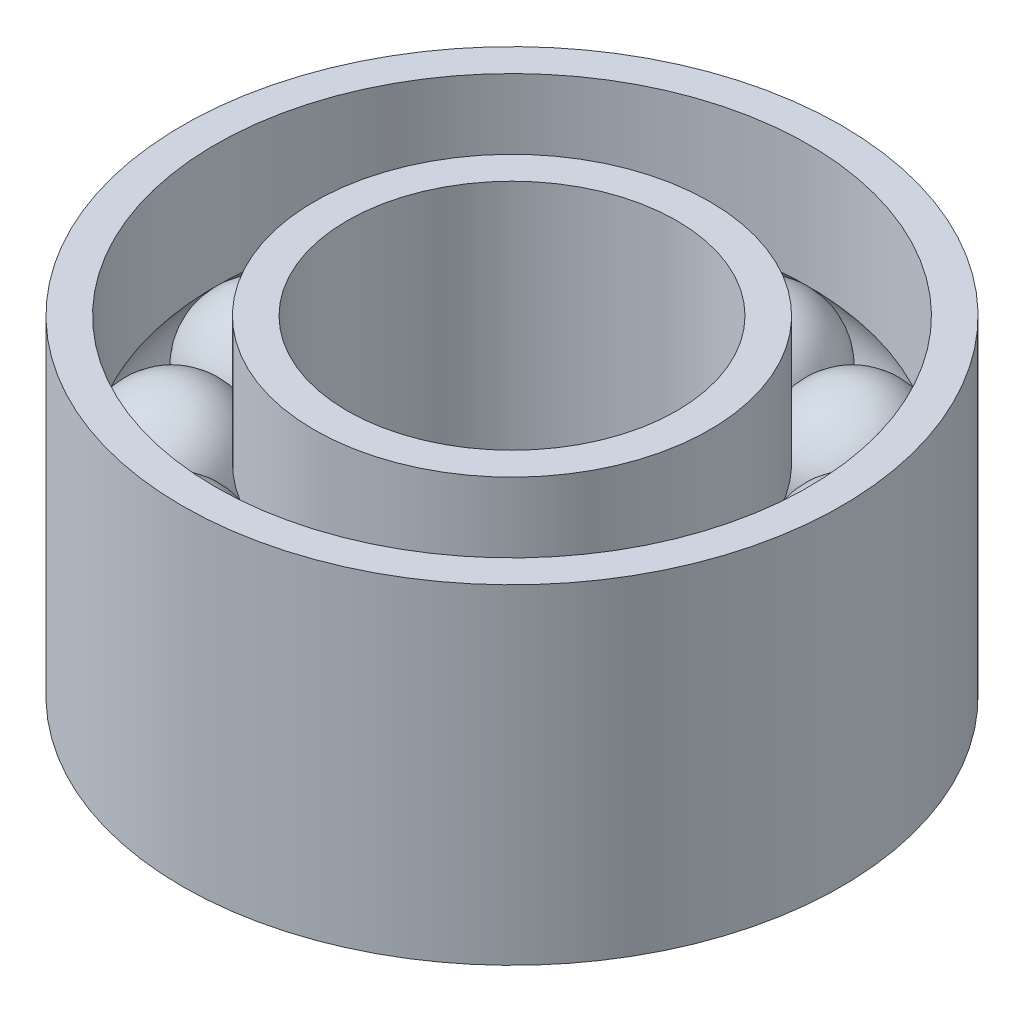
ISO-10303-21;
HEADER;
FILE_DESCRIPTION(('STEP AP214'),'2;1');
FILE_NAME('part.step','',(''),(''),'','','');
FILE_SCHEMA(('AUTOMOTIVE_DESIGN { 1 0 10303 214 1 1 1 1 }'));
ENDSEC;
DATA;
#1=APPLICATION_CONTEXT('core data for automotive mechanical design processes');
#2=APPLICATION_PROTOCOL_DEFINITION('international standard','automotive_design',2000,#1);
#3=PRODUCT_CONTEXT('',#1,'mechanical');
#4=PRODUCT('Part','Part','',(#3));
#5=PRODUCT_RELATED_PRODUCT_CATEGORY('part','',(#4));
#6=PRODUCT_DEFINITION_FORMATION('','',#4);
#7=PRODUCT_DEFINITION_CONTEXT('part definition',#1,'design');
#8=PRODUCT_DEFINITION('design','',#6,#7);
#9=PRODUCT_DEFINITION_SHAPE('','',#8);
#10=(LENGTH_UNIT() NAMED_UNIT(*) SI_UNIT(.MILLI.,.METRE.));
#11=(NAMED_UNIT(*) PLANE_ANGLE_UNIT() SI_UNIT($,.RADIAN.));
#12=(NAMED_UNIT(*) SI_UNIT($,.STERADIAN.) SOLID_ANGLE_UNIT());
#13=UNCERTAINTY_MEASURE_WITH_UNIT(LENGTH_MEASURE(1.E-05),#10,'distance_accuracy_value','');
#14=(GEOMETRIC_REPRESENTATION_CONTEXT(3) GLOBAL_UNCERTAINTY_ASSIGNED_CONTEXT((#13)) GLOBAL_UNIT_ASSIGNED_CONTEXT((#10,
#11,#12)) REPRESENTATION_CONTEXT('',''));
#15=CARTESIAN_POINT('',(0.,0.,0.));
#16=DIRECTION('',(0.,0.,1.));
#17=DIRECTION('',(1.,0.,0.));
#18=AXIS2_PLACEMENT_3D('',#15,#16,#17);
#19=CARTESIAN_POINT('',(0.,6.985,0.));
#20=DIRECTION('',(0.,1.,0.));
#21=DIRECTION('',(0.,0.,1.));
#22=AXIS2_PLACEMENT_3D('',#19,#20,#21);
#23=CYLINDRICAL_SURFACE('',#22,11.43);
#24=CARTESIAN_POINT('',(0.,-1.91447605889664,0.));
#25=DIRECTION('',(0.,1.,0.));
#26=DIRECTION('',(0.,0.,1.));
#27=AXIS2_PLACEMENT_3D('',#24,#25,#26);
#28=CIRCLE('',#27,11.43);
#29=CARTESIAN_POINT('',(0.,-1.91447605889664,11.43));
#30=VERTEX_POINT('',#29);
#31=EDGE_CURVE('E11',#30,#30,#28,.T.);
#32=ORIENTED_EDGE('',*,*,#31,.T.);
#33=EDGE_LOOP('',(#32));
#34=FACE_BOUND('',#33,.T.);
#35=CARTESIAN_POINT('',(0.,-6.35,0.));
#36=DIRECTION('',(0.,1.,0.));
#37=DIRECTION('',(0.,0.,1.));
#38=AXIS2_PLACEMENT_3D('',#35,#36,#37);
#39=CIRCLE('',#38,11.43);
#40=CARTESIAN_POINT('',(0.,-6.35,11.43));
#41=VERTEX_POINT('',#40);
#42=EDGE_CURVE('E72',#41,#41,#39,.T.);
#43=ORIENTED_EDGE('',*,*,#42,.F.);
#44=EDGE_LOOP('',(#43));
#45=FACE_BOUND('',#44,.T.);
#46=ADVANCED_FACE('F45',(#34,#45),#23,.F.);
#47=CARTESIAN_POINT('',(0.,-0.15199306274035,0.));
#48=DIRECTION('',(0.,1.,0.));
#49=DIRECTION('',(0.,0.,1.));
#50=AXIS2_PLACEMENT_3D('',#47,#48,#49);
#51=TOROIDAL_SURFACE('',#50,9.60099653137017,2.54);
#52=ORIENTED_EDGE('',*,*,#31,.F.);
#53=EDGE_LOOP('',(#52));
#54=FACE_BOUND('',#53,.T.);
#55=CARTESIAN_POINT('',(0.,1.61048993341594,0.));
#56=DIRECTION('',(0.,1.,0.));
#57=DIRECTION('',(0.,0.,1.));
#58=AXIS2_PLACEMENT_3D('',#55,#56,#57);
#59=CIRCLE('',#58,11.43);
#60=CARTESIAN_POINT('',(0.,1.61048993341594,11.43));
#61=VERTEX_POINT('',#60);
#62=EDGE_CURVE('E52',#61,#61,#59,.T.);
#63=ORIENTED_EDGE('',*,*,#62,.T.);
#64=EDGE_LOOP('',(#63));
#65=FACE_BOUND('',#64,.T.);
#66=ADVANCED_FACE('F81',(#54,#65),#51,.F.);
#67=CARTESIAN_POINT('',(0.,6.985,0.));
#68=DIRECTION('',(0.,1.,0.));
#69=DIRECTION('',(0.,0.,1.));
#70=AXIS2_PLACEMENT_3D('',#67,#68,#69);
#71=CYLINDRICAL_SURFACE('',#70,11.43);
#72=CARTESIAN_POINT('',(0.,6.35,0.));
#73=DIRECTION('',(0.,1.,0.));
#74=DIRECTION('',(0.,0.,1.));
#75=AXIS2_PLACEMENT_3D('',#72,#73,#74);
#76=CIRCLE('',#75,11.43);
#77=CARTESIAN_POINT('',(0.,6.35,11.43));
#78=VERTEX_POINT('',#77);
#79=EDGE_CURVE('E57',#78,#78,#76,.T.);
#80=ORIENTED_EDGE('',*,*,#79,.T.);
#81=EDGE_LOOP('',(#80));
#82=FACE_BOUND('',#81,.T.);
#83=ORIENTED_EDGE('',*,*,#62,.F.);
#84=EDGE_LOOP('',(#83));
#85=FACE_BOUND('',#84,.T.);
#86=ADVANCED_FACE('F85',(#82,#85),#71,.F.);
#87=CARTESIAN_POINT('',(-12.7,6.35,0.));
#88=DIRECTION('',(0.,1.,0.));
#89=DIRECTION('',(0.,0.,1.));
#90=AXIS2_PLACEMENT_3D('',#87,#88,#89);
#91=PLANE('',#90);
#92=CARTESIAN_POINT('',(0.,6.35,0.));
#93=DIRECTION('',(0.,1.,0.));
#94=DIRECTION('',(0.,0.,1.));
#95=AXIS2_PLACEMENT_3D('',#92,#93,#94);
#96=CIRCLE('',#95,12.7);
#97=CARTESIAN_POINT('',(0.,6.35,12.7));
#98=VERTEX_POINT('',#97);
#99=EDGE_CURVE('E62',#98,#98,#96,.T.);
#100=ORIENTED_EDGE('',*,*,#99,.T.);
#101=EDGE_LOOP('',(#100));
#102=FACE_BOUND('',#101,.T.);
#103=ORIENTED_EDGE('',*,*,#79,.F.);
#104=EDGE_LOOP('',(#103));
#105=FACE_BOUND('',#104,.T.);
#106=ADVANCED_FACE('F90',(#102,#105),#91,.T.);
#107=CARTESIAN_POINT('',(0.,6.985,0.));
#108=DIRECTION('',(0.,1.,0.));
#109=DIRECTION('',(0.,0.,1.));
#110=AXIS2_PLACEMENT_3D('',#107,#108,#109);
#111=CYLINDRICAL_SURFACE('',#110,12.7);
#112=CARTESIAN_POINT('',(0.,-6.35,0.));
#113=DIRECTION('',(0.,1.,0.));
#114=DIRECTION('',(0.,0.,1.));
#115=AXIS2_PLACEMENT_3D('',#112,#113,#114);
#116=CIRCLE('',#115,12.7);
#117=CARTESIAN_POINT('',(0.,-6.35,12.7));
#118=VERTEX_POINT('',#117);
#119=EDGE_CURVE('E68',#118,#118,#116,.T.);
#120=ORIENTED_EDGE('',*,*,#119,.T.);
#121=EDGE_LOOP('',(#120));
#122=FACE_BOUND('',#121,.T.);
#123=ORIENTED_EDGE('',*,*,#99,.F.);
#124=EDGE_LOOP('',(#123));
#125=FACE_BOUND('',#124,.T.);
#126=ADVANCED_FACE('F96',(#122,#125),#111,.T.);
#127=CARTESIAN_POINT('',(-12.7,-6.35,0.));
#128=DIRECTION('',(0.,-1.,0.));
#129=DIRECTION('',(0.,0.,-1.));
#130=AXIS2_PLACEMENT_3D('',#127,#128,#129);
#131=PLANE('',#130);
#132=ORIENTED_EDGE('',*,*,#42,.T.);
#133=EDGE_LOOP('',(#132));
#134=FACE_BOUND('',#133,.T.);
#135=ORIENTED_EDGE('',*,*,#119,.F.);
#136=EDGE_LOOP('',(#135));
#137=FACE_BOUND('',#136,.T.);
#138=ADVANCED_FACE('F77',(#134,#137),#131,.T.);
#139=CLOSED_SHELL('',(#46,#66,#86,#106,#126,#138));
#140=MANIFOLD_SOLID_BREP('B2',#139);
#141=CARTESIAN_POINT('',(0.,6.985,0.));
#142=DIRECTION('',(0.,1.,0.));
#143=DIRECTION('',(0.,0.,1.));
#144=AXIS2_PLACEMENT_3D('',#141,#142,#143);
#145=CYLINDRICAL_SURFACE('',#144,6.35);
#146=CARTESIAN_POINT('',(0.,6.35,0.));
#147=DIRECTION('',(0.,1.,0.));
#148=DIRECTION('',(0.,0.,1.));
#149=AXIS2_PLACEMENT_3D('',#146,#147,#148);
#150=CIRCLE('',#149,6.35);
#151=CARTESIAN_POINT('',(0.,6.35,6.35));
#152=VERTEX_POINT('',#151);
#153=EDGE_CURVE('E44',#152,#152,#150,.T.);
#154=ORIENTED_EDGE('',*,*,#153,.T.);
#155=EDGE_LOOP('',(#154));
#156=FACE_BOUND('',#155,.T.);
#157=CARTESIAN_POINT('',(0.,-6.35,0.));
#158=DIRECTION('',(0.,1.,0.));
#159=DIRECTION('',(0.,0.,1.));
#160=AXIS2_PLACEMENT_3D('',#157,#158,#159);
#161=CIRCLE('',#160,6.35);
#162=CARTESIAN_POINT('',(0.,-6.35,6.35));
#163=VERTEX_POINT('',#162);
#164=EDGE_CURVE('E171',#163,#163,#161,.T.);
#165=ORIENTED_EDGE('',*,*,#164,.F.);
#166=EDGE_LOOP('',(#165));
#167=FACE_BOUND('',#166,.T.);
#168=ADVANCED_FACE('F149',(#156,#167),#145,.F.);
#169=CARTESIAN_POINT('',(-7.62,6.35,0.));
#170=DIRECTION('',(0.,1.,0.));
#171=DIRECTION('',(0.,0.,1.));
#172=AXIS2_PLACEMENT_3D('',#169,#170,#171);
#173=PLANE('',#172);
#174=CARTESIAN_POINT('',(0.,6.35,0.));
#175=DIRECTION('',(0.,1.,0.));
#176=DIRECTION('',(0.,0.,1.));
#177=AXIS2_PLACEMENT_3D('',#174,#175,#176);
#178=CIRCLE('',#177,7.62);
#179=CARTESIAN_POINT('',(0.,6.35,7.62));
#180=VERTEX_POINT('',#179);
#181=EDGE_CURVE('E155',#180,#180,#178,.T.);
#182=ORIENTED_EDGE('',*,*,#181,.T.);
#183=EDGE_LOOP('',(#182));
#184=FACE_BOUND('',#183,.T.);
#185=ORIENTED_EDGE('',*,*,#153,.F.);
#186=EDGE_LOOP('',(#185));
#187=FACE_BOUND('',#186,.T.);
#188=ADVANCED_FACE('F179',(#184,#187),#173,.T.);
#189=CARTESIAN_POINT('',(0.,6.985,0.));
#190=DIRECTION('',(0.,1.,0.));
#191=DIRECTION('',(0.,0.,1.));
#192=AXIS2_PLACEMENT_3D('',#189,#190,#191);
#193=CYLINDRICAL_SURFACE('',#192,7.62);
#194=CARTESIAN_POINT('',(0.,1.43774048181967,0.));
#195=DIRECTION('',(0.,1.,0.));
#196=DIRECTION('',(0.,0.,1.));
#197=AXIS2_PLACEMENT_3D('',#194,#195,#196);
#198=CIRCLE('',#197,7.62);
#199=CARTESIAN_POINT('',(0.,1.43774048181967,7.62));
#200=VERTEX_POINT('',#199);
#201=EDGE_CURVE('E159',#200,#200,#198,.T.);
#202=ORIENTED_EDGE('',*,*,#201,.T.);
#203=EDGE_LOOP('',(#202));
#204=FACE_BOUND('',#203,.T.);
#205=ORIENTED_EDGE('',*,*,#181,.F.);
#206=EDGE_LOOP('',(#205));
#207=FACE_BOUND('',#206,.T.);
#208=ADVANCED_FACE('F183',(#204,#207),#193,.T.);
#209=CARTESIAN_POINT('',(0.,-0.15199306274035,0.));
#210=DIRECTION('',(0.,1.,0.));
#211=DIRECTION('',(0.,0.,1.));
#212=AXIS2_PLACEMENT_3D('',#209,#210,#211);
#213=TOROIDAL_SURFACE('',#212,9.60099653137017,2.54);
#214=ORIENTED_EDGE('',*,*,#201,.F.);
#215=EDGE_LOOP('',(#214));
#216=FACE_BOUND('',#215,.T.);
#217=CARTESIAN_POINT('',(0.,-1.74172660730037,0.));
#218=DIRECTION('',(0.,1.,0.));
#219=DIRECTION('',(0.,0.,1.));
#220=AXIS2_PLACEMENT_3D('',#217,#218,#219);
#221=CIRCLE('',#220,7.62);
#222=CARTESIAN_POINT('',(0.,-1.74172660730037,7.62));
#223=VERTEX_POINT('',#222);
#224=EDGE_CURVE('E163',#223,#223,#221,.T.);
#225=ORIENTED_EDGE('',*,*,#224,.T.);
#226=EDGE_LOOP('',(#225));
#227=FACE_BOUND('',#226,.T.);
#228=ADVANCED_FACE('F187',(#216,#227),#213,.F.);
#229=CARTESIAN_POINT('',(0.,6.985,0.));
#230=DIRECTION('',(0.,1.,0.));
#231=DIRECTION('',(0.,0.,1.));
#232=AXIS2_PLACEMENT_3D('',#229,#230,#231);
#233=CYLINDRICAL_SURFACE('',#232,7.62);
#234=CARTESIAN_POINT('',(0.,-6.35,0.));
#235=DIRECTION('',(0.,1.,0.));
#236=DIRECTION('',(0.,0.,1.));
#237=AXIS2_PLACEMENT_3D('',#234,#235,#236);
#238=CIRCLE('',#237,7.62);
#239=CARTESIAN_POINT('',(0.,-6.35,7.62));
#240=VERTEX_POINT('',#239);
#241=EDGE_CURVE('E168',#240,#240,#238,.T.);
#242=ORIENTED_EDGE('',*,*,#241,.T.);
#243=EDGE_LOOP('',(#242));
#244=FACE_BOUND('',#243,.T.);
#245=ORIENTED_EDGE('',*,*,#224,.F.);
#246=EDGE_LOOP('',(#245));
#247=FACE_BOUND('',#246,.T.);
#248=ADVANCED_FACE('F194',(#244,#247),#233,.T.);
#249=CARTESIAN_POINT('',(-7.62,-6.35,0.));
#250=DIRECTION('',(0.,-1.,0.));
#251=DIRECTION('',(0.,0.,-1.));
#252=AXIS2_PLACEMENT_3D('',#249,#250,#251);
#253=PLANE('',#252);
#254=ORIENTED_EDGE('',*,*,#164,.T.);
#255=EDGE_LOOP('',(#254));
#256=FACE_BOUND('',#255,.T.);
#257=ORIENTED_EDGE('',*,*,#241,.F.);
#258=EDGE_LOOP('',(#257));
#259=FACE_BOUND('',#258,.T.);
#260=ADVANCED_FACE('F175',(#256,#259),#253,.T.);
#261=CLOSED_SHELL('',(#168,#188,#208,#228,#248,#260));
#262=MANIFOLD_SOLID_BREP('B6',#261);
#263=CARTESIAN_POINT('',(-8.31470689781285,-0.15199306274035,-4.80049826568509));
#264=DIRECTION('',(0.,1.,0.));
#265=DIRECTION('',(0.866025403784438,0.,0.500000000000001));
#266=AXIS2_PLACEMENT_3D('',#263,#264,#265);
#267=SPHERICAL_SURFACE('',#266,2.54);
#268=CARTESIAN_POINT('',(-6.55760258174896,-0.15199306274035,-6.55760258174897));
#269=DIRECTION('',(0.707106781186549,0.,-0.707106781186546));
#270=DIRECTION('',(-0.707106781186546,0.,-0.707106781186549));
#271=AXIS2_PLACEMENT_3D('',#268,#269,#270);
#272=CIRCLE('',#271,0.526088248242959);
#273=CARTESIAN_POINT('',(-6.9296031495841,-0.15199306274035,-6.92960314958412));
#274=VERTEX_POINT('',#273);
#275=EDGE_CURVE('E251',#274,#274,#272,.T.);
#276=ORIENTED_EDGE('',*,*,#275,.F.);
#277=EDGE_LOOP('',(#276));
#278=FACE_BOUND('',#277,.T.);
#279=CARTESIAN_POINT('',(-8.95785171459151,-0.15199306274035,-2.40024913284255));
#280=DIRECTION('',(0.258819045102521,0.,-0.965925826289068));
#281=DIRECTION('',(-0.965925826289068,0.,-0.258819045102521));
#282=AXIS2_PLACEMENT_3D('',#279,#280,#281);
#283=CIRCLE('',#282,0.526088248242959);
#284=CARTESIAN_POINT('',(-9.46601394047656,-0.15199306274035,-2.53641079089245));
#285=VERTEX_POINT('',#284);
#286=EDGE_CURVE('E148',#285,#285,#283,.T.);
#287=ORIENTED_EDGE('',*,*,#286,.T.);
#288=EDGE_LOOP('',(#287));
#289=FACE_BOUND('',#288,.T.);
#290=ADVANCED_FACE('F240',(#278,#289),#267,.T.);
#291=CARTESIAN_POINT('',(-8.3147068978129,-0.15199306274035,4.800498265685));
#292=DIRECTION('',(0.,1.,0.));
#293=DIRECTION('',(0.866025403784444,0.,-0.499999999999991));
#294=AXIS2_PLACEMENT_3D('',#291,#292,#293);
#295=SPHERICAL_SURFACE('',#294,2.54);
#296=CARTESIAN_POINT('',(-6.55760258174903,-0.15199306274035,6.5576025817489));
#297=DIRECTION('',(-0.70710678118654,0.,-0.707106781186555));
#298=DIRECTION('',(-0.707106781186555,0.,0.70710678118654));
#299=AXIS2_PLACEMENT_3D('',#296,#297,#298);
#300=CIRCLE('',#299,0.526088248242973);
#301=CARTESIAN_POINT('',(-6.92960314958419,-0.15199306274035,6.92960314958405));
#302=VERTEX_POINT('',#301);
#303=EDGE_CURVE('E281',#302,#302,#300,.T.);
#304=ORIENTED_EDGE('',*,*,#303,.T.);
#305=EDGE_LOOP('',(#304));
#306=FACE_BOUND('',#305,.T.);
#307=CARTESIAN_POINT('',(-8.95785171459153,-0.15199306274035,2.4002491328425));
#308=DIRECTION('',(0.258819045102516,0.,0.96592582628907));
#309=DIRECTION('',(0.96592582628907,0.,-0.258819045102516));
#310=AXIS2_PLACEMENT_3D('',#307,#308,#309);
#311=CIRCLE('',#310,0.526088248243198);
#312=CARTESIAN_POINT('',(-8.44968948870625,-0.15199306274035,2.26408747479254));
#313=VERTEX_POINT('',#312);
#314=EDGE_CURVE('E247',#313,#313,#311,.T.);
#315=ORIENTED_EDGE('',*,*,#314,.T.);
#316=EDGE_LOOP('',(#315));
#317=FACE_BOUND('',#316,.T.);
#318=ADVANCED_FACE('F285',(#306,#317),#295,.T.);
#319=CARTESIAN_POINT('',(-4.80049826568507,-0.15199306274035,-8.31470689781285));
#320=DIRECTION('',(0.,1.,0.));
#321=DIRECTION('',(0.499999999999998,0.,0.86602540378444));
#322=AXIS2_PLACEMENT_3D('',#319,#320,#321);
#323=SPHERICAL_SURFACE('',#322,2.54);
#324=CARTESIAN_POINT('',(-2.40024913284252,-0.15199306274035,-8.95785171459151));
#325=DIRECTION('',(0.965925826289069,0.,-0.258819045102519));
#326=DIRECTION('',(-0.258819045102519,0.,-0.965925826289069));
#327=AXIS2_PLACEMENT_3D('',#324,#325,#326);
#328=CIRCLE('',#327,0.526088248242959);
#329=CARTESIAN_POINT('',(-2.53641079089242,-0.15199306274035,-9.46601394047656));
#330=VERTEX_POINT('',#329);
#331=EDGE_CURVE('E255',#330,#330,#328,.T.);
#332=ORIENTED_EDGE('',*,*,#331,.F.);
#333=EDGE_LOOP('',(#332));
#334=FACE_BOUND('',#333,.T.);
#335=ORIENTED_EDGE('',*,*,#275,.T.);
#336=EDGE_LOOP('',(#335));
#337=FACE_BOUND('',#336,.T.);
#338=ADVANCED_FACE('F332',(#334,#337),#323,.T.);
#339=CARTESIAN_POINT('',(0.,-0.15199306274035,-9.60099653137017));
#340=DIRECTION('',(0.,1.,0.));
#341=DIRECTION('',(0.,0.,1.));
#342=AXIS2_PLACEMENT_3D('',#339,#340,#341);
#343=SPHERICAL_SURFACE('',#342,2.54);
#344=CARTESIAN_POINT('',(2.40024913284257,-0.15199306274035,-8.9578517145915));
#345=DIRECTION('',(0.965925826289067,0.,0.258819045102524));
#346=DIRECTION('',(0.258819045102524,0.,-0.965925826289068));
#347=AXIS2_PLACEMENT_3D('',#344,#345,#346);
#348=CIRCLE('',#347,0.526088248242959);
#349=CARTESIAN_POINT('',(2.53641079089247,-0.15199306274035,-9.46601394047655));
#350=VERTEX_POINT('',#349);
#351=EDGE_CURVE('E260',#350,#350,#348,.T.);
#352=ORIENTED_EDGE('',*,*,#351,.F.);
#353=EDGE_LOOP('',(#352));
#354=FACE_BOUND('',#353,.T.);
#355=ORIENTED_EDGE('',*,*,#331,.T.);
#356=EDGE_LOOP('',(#355));
#357=FACE_BOUND('',#356,.T.);
#358=ADVANCED_FACE('F326',(#354,#357),#343,.T.);
#359=CARTESIAN_POINT('',(4.80049826568512,-0.15199306274035,-8.31470689781283));
#360=DIRECTION('',(0.,1.,0.));
#361=DIRECTION('',(-0.500000000000003,0.,0.866025403784437));
#362=AXIS2_PLACEMENT_3D('',#359,#360,#361);
#363=SPHERICAL_SURFACE('',#362,2.54);
#364=CARTESIAN_POINT('',(6.55760258174899,-0.15199306274035,-6.55760258174894));
#365=DIRECTION('',(0.707106781186545,0.,0.707106781186551));
#366=DIRECTION('',(0.707106781186551,0.,-0.707106781186545));
#367=AXIS2_PLACEMENT_3D('',#364,#365,#366);
#368=CIRCLE('',#367,0.526088248242952);
#369=CARTESIAN_POINT('',(6.92960314958414,-0.15199306274035,-6.92960314958408));
#370=VERTEX_POINT('',#369);
#371=EDGE_CURVE('E263',#370,#370,#368,.T.);
#372=ORIENTED_EDGE('',*,*,#371,.F.);
#373=EDGE_LOOP('',(#372));
#374=FACE_BOUND('',#373,.T.);
#375=ORIENTED_EDGE('',*,*,#351,.T.);
#376=EDGE_LOOP('',(#375));
#377=FACE_BOUND('',#376,.T.);
#378=ADVANCED_FACE('F320',(#374,#377),#363,.T.);
#379=CARTESIAN_POINT('',(8.31470689781287,-0.15199306274035,-4.80049826568504));
#380=DIRECTION('',(0.,1.,0.));
#381=DIRECTION('',(-0.866025403784441,0.,0.499999999999996));
#382=AXIS2_PLACEMENT_3D('',#379,#380,#381);
#383=SPHERICAL_SURFACE('',#382,2.54);
#384=CARTESIAN_POINT('',(8.95785171459152,-0.15199306274035,-2.40024913284249));
#385=DIRECTION('',(0.258819045102516,0.,0.96592582628907));
#386=DIRECTION('',(0.96592582628907,0.,-0.258819045102516));
#387=AXIS2_PLACEMENT_3D('',#384,#385,#386);
#388=CIRCLE('',#387,0.52608824824296);
#389=CARTESIAN_POINT('',(9.46601394047657,-0.15199306274035,-2.53641079089239));
#390=VERTEX_POINT('',#389);
#391=EDGE_CURVE('E266',#390,#390,#388,.T.);
#392=ORIENTED_EDGE('',*,*,#391,.F.);
#393=EDGE_LOOP('',(#392));
#394=FACE_BOUND('',#393,.T.);
#395=ORIENTED_EDGE('',*,*,#371,.T.);
#396=EDGE_LOOP('',(#395));
#397=FACE_BOUND('',#396,.T.);
#398=ADVANCED_FACE('F314',(#394,#397),#383,.T.);
#399=CARTESIAN_POINT('',(9.60099653137017,-0.15199306274035,0.));
#400=DIRECTION('',(0.,1.,0.));
#401=DIRECTION('',(-1.,0.,0.));
#402=AXIS2_PLACEMENT_3D('',#399,#400,#401);
#403=SPHERICAL_SURFACE('',#402,2.54);
#404=CARTESIAN_POINT('',(8.9578517145915,-0.15199306274035,2.4002491328426));
#405=DIRECTION('',(-0.258819045102526,0.,0.965925826289067));
#406=DIRECTION('',(0.965925826289067,0.,0.258819045102526));
#407=AXIS2_PLACEMENT_3D('',#404,#405,#406);
#408=CIRCLE('',#407,0.526088248242964);
#409=CARTESIAN_POINT('',(9.46601394047655,-0.15199306274035,2.5364107908925));
#410=VERTEX_POINT('',#409);
#411=EDGE_CURVE('E269',#410,#410,#408,.T.);
#412=ORIENTED_EDGE('',*,*,#411,.F.);
#413=EDGE_LOOP('',(#412));
#414=FACE_BOUND('',#413,.T.);
#415=ORIENTED_EDGE('',*,*,#391,.T.);
#416=EDGE_LOOP('',(#415));
#417=FACE_BOUND('',#416,.T.);
#418=ADVANCED_FACE('F308',(#414,#417),#403,.T.);
#419=CARTESIAN_POINT('',(8.31470689781282,-0.15199306274035,4.80049826568514));
#420=DIRECTION('',(0.,1.,0.));
#421=DIRECTION('',(-0.866025403784435,0.,-0.500000000000006));
#422=AXIS2_PLACEMENT_3D('',#419,#420,#421);
#423=SPHERICAL_SURFACE('',#422,2.54);
#424=CARTESIAN_POINT('',(6.55760258174892,-0.15199306274035,6.55760258174901));
#425=DIRECTION('',(-0.707106781186552,0.,0.707106781186543));
#426=DIRECTION('',(0.707106781186543,0.,0.707106781186552));
#427=AXIS2_PLACEMENT_3D('',#424,#425,#426);
#428=CIRCLE('',#427,0.526088248242951);
#429=CARTESIAN_POINT('',(6.92960314958406,-0.15199306274035,6.92960314958416));
#430=VERTEX_POINT('',#429);
#431=EDGE_CURVE('E272',#430,#430,#428,.T.);
#432=ORIENTED_EDGE('',*,*,#431,.F.);
#433=EDGE_LOOP('',(#432));
#434=FACE_BOUND('',#433,.T.);
#435=ORIENTED_EDGE('',*,*,#411,.T.);
#436=EDGE_LOOP('',(#435));
#437=FACE_BOUND('',#436,.T.);
#438=ADVANCED_FACE('F302',(#434,#437),#423,.T.);
#439=CARTESIAN_POINT('',(4.80049826568502,-0.15199306274035,8.31470689781288));
#440=DIRECTION('',(0.,1.,0.));
#441=DIRECTION('',(-0.499999999999994,0.,-0.866025403784443));
#442=AXIS2_PLACEMENT_3D('',#439,#440,#441);
#443=SPHERICAL_SURFACE('',#442,2.54);
#444=CARTESIAN_POINT('',(2.40024913284247,-0.15199306274035,8.95785171459153));
#445=DIRECTION('',(-0.96592582628907,0.,0.258819045102513));
#446=DIRECTION('',(0.258819045102513,0.,0.965925826289071));
#447=AXIS2_PLACEMENT_3D('',#444,#445,#446);
#448=CIRCLE('',#447,0.526088248242951);
#449=CARTESIAN_POINT('',(2.53641079089236,-0.15199306274035,9.46601394047657));
#450=VERTEX_POINT('',#449);
#451=EDGE_CURVE('E275',#450,#450,#448,.T.);
#452=ORIENTED_EDGE('',*,*,#451,.F.);
#453=EDGE_LOOP('',(#452));
#454=FACE_BOUND('',#453,.T.);
#455=ORIENTED_EDGE('',*,*,#431,.T.);
#456=EDGE_LOOP('',(#455));
#457=FACE_BOUND('',#456,.T.);
#458=ADVANCED_FACE('F296',(#454,#457),#443,.T.);
#459=CARTESIAN_POINT('',(0.,-0.15199306274035,9.60099653137017));
#460=DIRECTION('',(0.,1.,0.));
#461=DIRECTION('',(0.,0.,-1.));
#462=AXIS2_PLACEMENT_3D('',#459,#460,#461);
#463=SPHERICAL_SURFACE('',#462,2.54);
#464=CARTESIAN_POINT('',(-2.40024913284263,-0.15199306274035,8.95785171459149));
#465=DIRECTION('',(-0.965925826289066,0.,-0.25881904510253));
#466=DIRECTION('',(-0.25881904510253,0.,0.965925826289066));
#467=AXIS2_PLACEMENT_3D('',#464,#465,#466);
#468=CIRCLE('',#467,0.526088248242951);
#469=CARTESIAN_POINT('',(-2.53641079089253,-0.15199306274035,9.46601394047653));
#470=VERTEX_POINT('',#469);
#471=EDGE_CURVE('E278',#470,#470,#468,.T.);
#472=ORIENTED_EDGE('',*,*,#471,.F.);
#473=EDGE_LOOP('',(#472));
#474=FACE_BOUND('',#473,.T.);
#475=ORIENTED_EDGE('',*,*,#451,.T.);
#476=EDGE_LOOP('',(#475));
#477=FACE_BOUND('',#476,.T.);
#478=ADVANCED_FACE('F290',(#474,#477),#463,.T.);
#479=CARTESIAN_POINT('',(-4.80049826568517,-0.15199306274035,8.3147068978128));
#480=DIRECTION('',(0.,1.,0.));
#481=DIRECTION('',(0.500000000000009,0.,-0.866025403784434));
#482=AXIS2_PLACEMENT_3D('',#479,#480,#481);
#483=SPHERICAL_SURFACE('',#482,2.54);
#484=ORIENTED_EDGE('',*,*,#303,.F.);
#485=EDGE_LOOP('',(#484));
#486=FACE_BOUND('',#485,.T.);
#487=ORIENTED_EDGE('',*,*,#471,.T.);
#488=EDGE_LOOP('',(#487));
#489=FACE_BOUND('',#488,.T.);
#490=ADVANCED_FACE('F287',(#486,#489),#483,.T.);
#491=CARTESIAN_POINT('',(-9.60099653137017,-0.15199306274035,0.));
#492=DIRECTION('',(0.,1.,0.));
#493=DIRECTION('',(1.,0.,0.));
#494=AXIS2_PLACEMENT_3D('',#491,#492,#493);
#495=SPHERICAL_SURFACE('',#494,2.54);
#496=ORIENTED_EDGE('',*,*,#314,.F.);
#497=EDGE_LOOP('',(#496));
#498=FACE_BOUND('',#497,.T.);
#499=ORIENTED_EDGE('',*,*,#286,.F.);
#500=EDGE_LOOP('',(#499));
#501=FACE_BOUND('',#500,.T.);
#502=ADVANCED_FACE('F242',(#498,#501),#495,.T.);
#503=CLOSED_SHELL('',(#290,#318,#338,#358,#378,#398,#418,#438,#458,#478,#490,#502));
#504=MANIFOLD_SOLID_BREP('B39',#503);
#505=ADVANCED_BREP_SHAPE_REPRESENTATION('',(#18,#140,#262,#504),#14);
#506=SHAPE_DEFINITION_REPRESENTATION(#9,#505);
ENDSEC;
END-ISO-10303-21;
